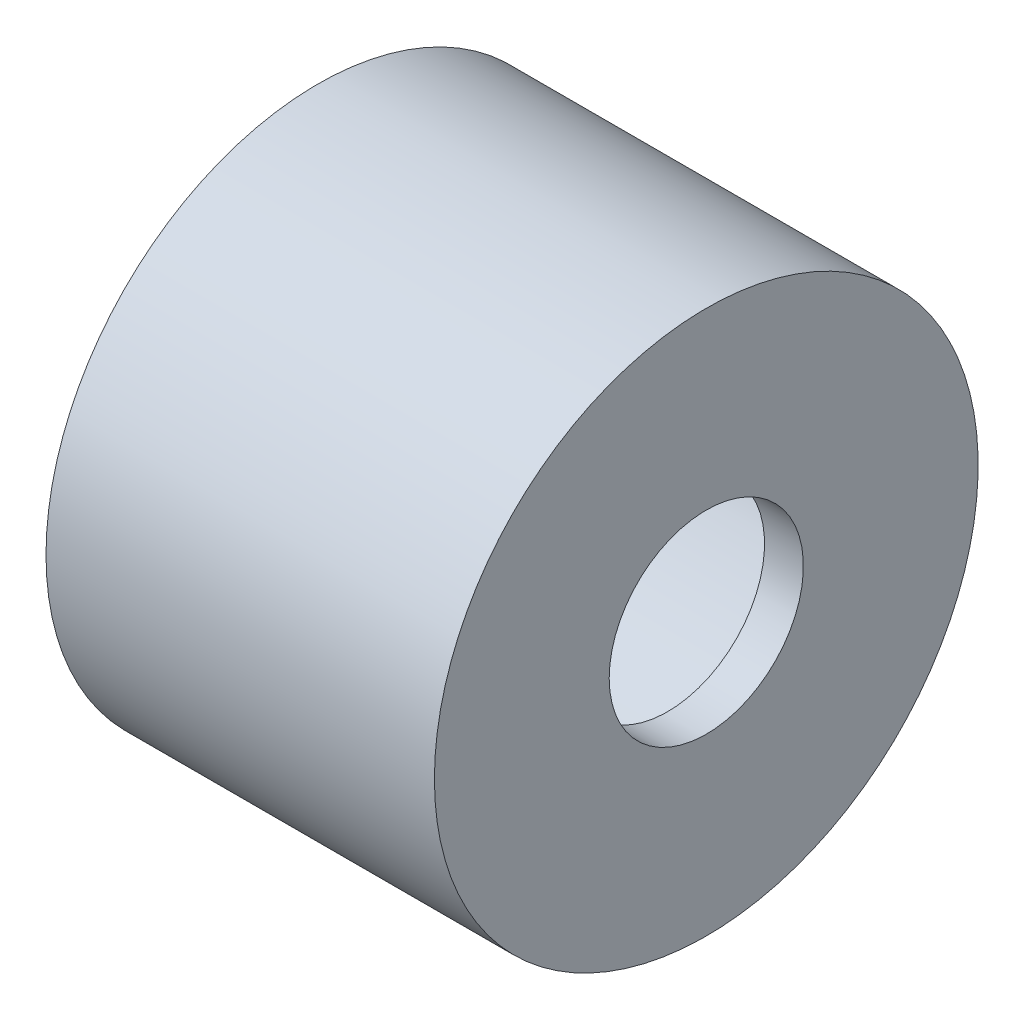
ISO-10303-21;
HEADER;
FILE_DESCRIPTION(('STEP AP214'),'2;1');
FILE_NAME('part.step','',(''),(''),'','','');
FILE_SCHEMA(('AUTOMOTIVE_DESIGN { 1 0 10303 214 1 1 1 1 }'));
ENDSEC;
DATA;
#1=APPLICATION_CONTEXT('core data for automotive mechanical design processes');
#2=APPLICATION_PROTOCOL_DEFINITION('international standard','automotive_design',2000,#1);
#3=PRODUCT_CONTEXT('',#1,'mechanical');
#4=PRODUCT('Part','Part','',(#3));
#5=PRODUCT_RELATED_PRODUCT_CATEGORY('part','',(#4));
#6=PRODUCT_DEFINITION_FORMATION('','',#4);
#7=PRODUCT_DEFINITION_CONTEXT('part definition',#1,'design');
#8=PRODUCT_DEFINITION('design','',#6,#7);
#9=PRODUCT_DEFINITION_SHAPE('','',#8);
#10=(LENGTH_UNIT() NAMED_UNIT(*) SI_UNIT(.MILLI.,.METRE.));
#11=(NAMED_UNIT(*) PLANE_ANGLE_UNIT() SI_UNIT($,.RADIAN.));
#12=(NAMED_UNIT(*) SI_UNIT($,.STERADIAN.) SOLID_ANGLE_UNIT());
#13=UNCERTAINTY_MEASURE_WITH_UNIT(LENGTH_MEASURE(1.E-05),#10,'distance_accuracy_value','');
#14=(GEOMETRIC_REPRESENTATION_CONTEXT(3) GLOBAL_UNCERTAINTY_ASSIGNED_CONTEXT((#13)) GLOBAL_UNIT_ASSIGNED_CONTEXT((#10,
#11,#12)) REPRESENTATION_CONTEXT('',''));
#15=CARTESIAN_POINT('',(0.,0.,0.));
#16=DIRECTION('',(0.,0.,1.));
#17=DIRECTION('',(1.,0.,0.));
#18=AXIS2_PLACEMENT_3D('',#15,#16,#17);
#19=CARTESIAN_POINT('',(0.,8.89,0.));
#20=DIRECTION('',(1.,0.,0.));
#21=DIRECTION('',(0.,0.,-1.));
#22=AXIS2_PLACEMENT_3D('',#19,#20,#21);
#23=PLANE('',#22);
#24=CARTESIAN_POINT('',(0.,0.,0.));
#25=DIRECTION('',(-1.,0.,0.));
#26=DIRECTION('',(0.,0.,1.));
#27=AXIS2_PLACEMENT_3D('',#24,#25,#26);
#28=CIRCLE('',#27,7.62);
#29=CARTESIAN_POINT('',(0.,0.,7.62));
#30=VERTEX_POINT('',#29);
#31=EDGE_CURVE('E10',#30,#30,#28,.T.);
#32=ORIENTED_EDGE('',*,*,#31,.F.);
#33=EDGE_LOOP('',(#32));
#34=FACE_BOUND('',#33,.T.);
#35=CARTESIAN_POINT('',(0.,0.,0.));
#36=DIRECTION('',(-1.,0.,0.));
#37=DIRECTION('',(0.,0.,1.));
#38=AXIS2_PLACEMENT_3D('',#35,#36,#37);
#39=CIRCLE('',#38,8.89);
#40=CARTESIAN_POINT('',(0.,0.,8.89));
#41=VERTEX_POINT('',#40);
#42=EDGE_CURVE('E53',#41,#41,#39,.T.);
#43=ORIENTED_EDGE('',*,*,#42,.T.);
#44=EDGE_LOOP('',(#43));
#45=FACE_BOUND('',#44,.T.);
#46=ADVANCED_FACE('F31',(#34,#45),#23,.F.);
#47=CARTESIAN_POINT('',(-0.305253564868368,0.,0.));
#48=DIRECTION('',(-1.,0.,0.));
#49=DIRECTION('',(0.,0.,1.));
#50=AXIS2_PLACEMENT_3D('',#47,#48,#49);
#51=CYLINDRICAL_SURFACE('',#50,7.62);
#52=CARTESIAN_POINT('',(11.43,0.,0.));
#53=DIRECTION('',(-1.,0.,0.));
#54=DIRECTION('',(0.,0.,1.));
#55=AXIS2_PLACEMENT_3D('',#52,#53,#54);
#56=CIRCLE('',#55,7.62);
#57=CARTESIAN_POINT('',(11.43,0.,7.62));
#58=VERTEX_POINT('',#57);
#59=EDGE_CURVE('E37',#58,#58,#56,.T.);
#60=ORIENTED_EDGE('',*,*,#59,.F.);
#61=EDGE_LOOP('',(#60));
#62=FACE_BOUND('',#61,.T.);
#63=ORIENTED_EDGE('',*,*,#31,.T.);
#64=EDGE_LOOP('',(#63));
#65=FACE_BOUND('',#64,.T.);
#66=ADVANCED_FACE('F78',(#62,#65),#51,.F.);
#67=CARTESIAN_POINT('',(11.43,7.62,0.));
#68=DIRECTION('',(1.,0.,0.));
#69=DIRECTION('',(0.,0.,-1.));
#70=AXIS2_PLACEMENT_3D('',#67,#68,#69);
#71=PLANE('',#70);
#72=CARTESIAN_POINT('',(11.43,0.,0.));
#73=DIRECTION('',(-1.,0.,0.));
#74=DIRECTION('',(0.,0.,1.));
#75=AXIS2_PLACEMENT_3D('',#72,#73,#74);
#76=CIRCLE('',#75,3.175);
#77=CARTESIAN_POINT('',(11.43,0.,3.175));
#78=VERTEX_POINT('',#77);
#79=EDGE_CURVE('E41',#78,#78,#76,.T.);
#80=ORIENTED_EDGE('',*,*,#79,.F.);
#81=EDGE_LOOP('',(#80));
#82=FACE_BOUND('',#81,.T.);
#83=ORIENTED_EDGE('',*,*,#59,.T.);
#84=EDGE_LOOP('',(#83));
#85=FACE_BOUND('',#84,.T.);
#86=ADVANCED_FACE('F73',(#82,#85),#71,.F.);
#87=CARTESIAN_POINT('',(-0.305253564868368,0.,0.));
#88=DIRECTION('',(-1.,0.,0.));
#89=DIRECTION('',(0.,0.,1.));
#90=AXIS2_PLACEMENT_3D('',#87,#88,#89);
#91=CYLINDRICAL_SURFACE('',#90,3.175);
#92=CARTESIAN_POINT('',(12.7,0.,0.));
#93=DIRECTION('',(-1.,0.,0.));
#94=DIRECTION('',(0.,0.,1.));
#95=AXIS2_PLACEMENT_3D('',#92,#93,#94);
#96=CIRCLE('',#95,3.175);
#97=CARTESIAN_POINT('',(12.7,0.,3.175));
#98=VERTEX_POINT('',#97);
#99=EDGE_CURVE('E45',#98,#98,#96,.T.);
#100=ORIENTED_EDGE('',*,*,#99,.F.);
#101=EDGE_LOOP('',(#100));
#102=FACE_BOUND('',#101,.T.);
#103=ORIENTED_EDGE('',*,*,#79,.T.);
#104=EDGE_LOOP('',(#103));
#105=FACE_BOUND('',#104,.T.);
#106=ADVANCED_FACE('F67',(#102,#105),#91,.F.);
#107=CARTESIAN_POINT('',(12.7,8.89,0.));
#108=DIRECTION('',(-1.,0.,0.));
#109=DIRECTION('',(0.,0.,1.));
#110=AXIS2_PLACEMENT_3D('',#107,#108,#109);
#111=PLANE('',#110);
#112=CARTESIAN_POINT('',(12.7,0.,0.));
#113=DIRECTION('',(-1.,0.,0.));
#114=DIRECTION('',(0.,0.,1.));
#115=AXIS2_PLACEMENT_3D('',#112,#113,#114);
#116=CIRCLE('',#115,8.89);
#117=CARTESIAN_POINT('',(12.7,0.,8.89));
#118=VERTEX_POINT('',#117);
#119=EDGE_CURVE('E50',#118,#118,#116,.T.);
#120=ORIENTED_EDGE('',*,*,#119,.F.);
#121=EDGE_LOOP('',(#120));
#122=FACE_BOUND('',#121,.T.);
#123=ORIENTED_EDGE('',*,*,#99,.T.);
#124=EDGE_LOOP('',(#123));
#125=FACE_BOUND('',#124,.T.);
#126=ADVANCED_FACE('F61',(#122,#125),#111,.F.);
#127=CARTESIAN_POINT('',(-0.305253564868368,0.,0.));
#128=DIRECTION('',(-1.,0.,0.));
#129=DIRECTION('',(0.,0.,1.));
#130=AXIS2_PLACEMENT_3D('',#127,#128,#129);
#131=CYLINDRICAL_SURFACE('',#130,8.89);
#132=ORIENTED_EDGE('',*,*,#42,.F.);
#133=EDGE_LOOP('',(#132));
#134=FACE_BOUND('',#133,.T.);
#135=ORIENTED_EDGE('',*,*,#119,.T.);
#136=EDGE_LOOP('',(#135));
#137=FACE_BOUND('',#136,.T.);
#138=ADVANCED_FACE('F58',(#134,#137),#131,.T.);
#139=CLOSED_SHELL('',(#46,#66,#86,#106,#126,#138));
#140=MANIFOLD_SOLID_BREP('B2',#139);
#141=ADVANCED_BREP_SHAPE_REPRESENTATION('',(#18,#140),#14);
#142=SHAPE_DEFINITION_REPRESENTATION(#9,#141);
ENDSEC;
END-ISO-10303-21;
